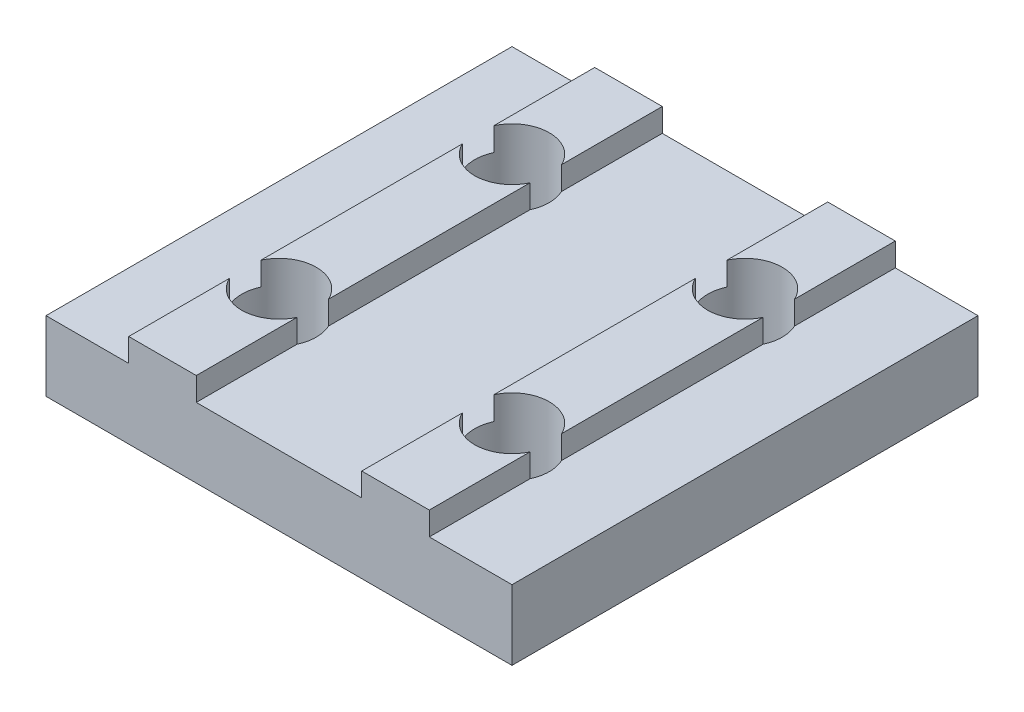
ISO-10303-21;
HEADER;
FILE_DESCRIPTION(('STEP AP214'),'2;1');
FILE_NAME('part.step','',(''),(''),'','','');
FILE_SCHEMA(('AUTOMOTIVE_DESIGN { 1 0 10303 214 1 1 1 1 }'));
ENDSEC;
DATA;
#1=APPLICATION_CONTEXT('core data for automotive mechanical design processes');
#2=APPLICATION_PROTOCOL_DEFINITION('international standard','automotive_design',2000,#1);
#3=PRODUCT_CONTEXT('',#1,'mechanical');
#4=PRODUCT('Part','Part','',(#3));
#5=PRODUCT_RELATED_PRODUCT_CATEGORY('part','',(#4));
#6=PRODUCT_DEFINITION_FORMATION('','',#4);
#7=PRODUCT_DEFINITION_CONTEXT('part definition',#1,'design');
#8=PRODUCT_DEFINITION('design','',#6,#7);
#9=PRODUCT_DEFINITION_SHAPE('','',#8);
#10=(LENGTH_UNIT() NAMED_UNIT(*) SI_UNIT(.MILLI.,.METRE.));
#11=(NAMED_UNIT(*) PLANE_ANGLE_UNIT() SI_UNIT($,.RADIAN.));
#12=(NAMED_UNIT(*) SI_UNIT($,.STERADIAN.) SOLID_ANGLE_UNIT());
#13=UNCERTAINTY_MEASURE_WITH_UNIT(LENGTH_MEASURE(1.E-05),#10,'distance_accuracy_value','');
#14=(GEOMETRIC_REPRESENTATION_CONTEXT(3) GLOBAL_UNCERTAINTY_ASSIGNED_CONTEXT((#13)) GLOBAL_UNIT_ASSIGNED_CONTEXT((#10,
#11,#12)) REPRESENTATION_CONTEXT('',''));
#15=CARTESIAN_POINT('',(0.,0.,0.));
#16=DIRECTION('',(0.,0.,1.));
#17=DIRECTION('',(1.,0.,0.));
#18=AXIS2_PLACEMENT_3D('',#15,#16,#17);
#19=CARTESIAN_POINT('',(-8.55,4.,20.));
#20=DIRECTION('',(-1.,0.,0.));
#21=DIRECTION('',(0.,-1.,0.));
#22=AXIS2_PLACEMENT_3D('',#19,#20,#21);
#23=PLANE('',#22);
#24=DIRECTION('',(0.,0.,-1.));
#25=VECTOR('',#24,1.);
#26=CARTESIAN_POINT('',(-8.55,3.,20.));
#27=LINE('',#26,#25);
#28=CARTESIAN_POINT('',(-8.55,3.,20.));
#29=VERTEX_POINT('',#28);
#30=CARTESIAN_POINT('',(-8.55,3.,15.6763874629234));
#31=VERTEX_POINT('',#30);
#32=EDGE_CURVE('E236',#29,#31,#27,.T.);
#33=ORIENTED_EDGE('',*,*,#32,.T.);
#34=DIRECTION('',(0.,1.,0.));
#35=VECTOR('',#34,1.);
#36=CARTESIAN_POINT('',(-8.55,0.,15.6763874629234));
#37=LINE('',#36,#35);
#38=CARTESIAN_POINT('',(-8.55,4.,15.6763874629234));
#39=VERTEX_POINT('',#38);
#40=EDGE_CURVE('E219',#31,#39,#37,.T.);
#41=ORIENTED_EDGE('',*,*,#40,.T.);
#42=DIRECTION('',(0.,0.,-1.));
#43=VECTOR('',#42,1.);
#44=CARTESIAN_POINT('',(-8.55,4.,20.));
#45=LINE('',#44,#43);
#46=CARTESIAN_POINT('',(-8.55,4.,20.));
#47=VERTEX_POINT('',#46);
#48=EDGE_CURVE('E233',#47,#39,#45,.T.);
#49=ORIENTED_EDGE('',*,*,#48,.F.);
#50=DIRECTION('',(0.,1.,0.));
#51=VECTOR('',#50,1.);
#52=CARTESIAN_POINT('',(-8.55,4.,20.));
#53=LINE('',#52,#51);
#54=EDGE_CURVE('E286',#29,#47,#53,.T.);
#55=ORIENTED_EDGE('',*,*,#54,.F.);
#56=EDGE_LOOP('',(#33,#41,#49,#55));
#57=FACE_BOUND('',#56,.T.);
#58=ADVANCED_FACE('F33',(#57),#23,.F.);
#59=CARTESIAN_POINT('',(-11.45,4.,20.));
#60=DIRECTION('',(0.,-1.,0.));
#61=DIRECTION('',(1.,0.,0.));
#62=AXIS2_PLACEMENT_3D('',#59,#60,#61);
#63=PLANE('',#62);
#64=ORIENTED_EDGE('',*,*,#48,.T.);
#65=CARTESIAN_POINT('',(-10.,4.,15.));
#66=DIRECTION('',(0.,1.,0.));
#67=DIRECTION('',(0.,0.,1.));
#68=AXIS2_PLACEMENT_3D('',#65,#66,#67);
#69=CIRCLE('',#68,1.6);
#70=CARTESIAN_POINT('',(-11.45,4.,15.6763874629234));
#71=VERTEX_POINT('',#70);
#72=EDGE_CURVE('E216',#71,#39,#69,.T.);
#73=ORIENTED_EDGE('',*,*,#72,.F.);
#74=DIRECTION('',(0.,0.,-1.));
#75=VECTOR('',#74,1.);
#76=CARTESIAN_POINT('',(-11.45,4.,20.));
#77=LINE('',#76,#75);
#78=CARTESIAN_POINT('',(-11.45,4.,20.));
#79=VERTEX_POINT('',#78);
#80=EDGE_CURVE('E249',#79,#71,#77,.T.);
#81=ORIENTED_EDGE('',*,*,#80,.F.);
#82=DIRECTION('',(-1.,0.,0.));
#83=VECTOR('',#82,1.);
#84=CARTESIAN_POINT('',(-11.45,4.,20.));
#85=LINE('',#84,#83);
#86=EDGE_CURVE('E241',#47,#79,#85,.T.);
#87=ORIENTED_EDGE('',*,*,#86,.F.);
#88=EDGE_LOOP('',(#64,#73,#81,#87));
#89=FACE_BOUND('',#88,.T.);
#90=ADVANCED_FACE('F240',(#89),#63,.F.);
#91=CARTESIAN_POINT('',(-11.45,3.,20.));
#92=DIRECTION('',(1.,0.,0.));
#93=DIRECTION('',(0.,0.,-1.));
#94=AXIS2_PLACEMENT_3D('',#91,#92,#93);
#95=PLANE('',#94);
#96=DIRECTION('',(0.,0.,-1.));
#97=VECTOR('',#96,1.);
#98=CARTESIAN_POINT('',(-11.45,3.,20.));
#99=LINE('',#98,#97);
#100=CARTESIAN_POINT('',(-11.45,3.,14.3236125370766));
#101=VERTEX_POINT('',#100);
#102=CARTESIAN_POINT('',(-11.45,3.,5.67638746292343));
#103=VERTEX_POINT('',#102);
#104=EDGE_CURVE('E265',#101,#103,#99,.T.);
#105=ORIENTED_EDGE('',*,*,#104,.F.);
#106=DIRECTION('',(0.,1.,0.));
#107=VECTOR('',#106,1.);
#108=CARTESIAN_POINT('',(-11.45,0.,14.3236125370766));
#109=LINE('',#108,#107);
#110=CARTESIAN_POINT('',(-11.45,4.,14.3236125370766));
#111=VERTEX_POINT('',#110);
#112=EDGE_CURVE('E48',#101,#111,#109,.T.);
#113=ORIENTED_EDGE('',*,*,#112,.T.);
#114=CARTESIAN_POINT('',(-11.45,4.,5.67638746292343));
#115=VERTEX_POINT('',#114);
#116=EDGE_CURVE('E255',#111,#115,#77,.T.);
#117=ORIENTED_EDGE('',*,*,#116,.T.);
#118=DIRECTION('',(0.,1.,0.));
#119=VECTOR('',#118,1.);
#120=CARTESIAN_POINT('',(-11.45,0.,5.67638746292343));
#121=LINE('',#120,#119);
#122=EDGE_CURVE('E313',#115,#103,#121,.F.);
#123=ORIENTED_EDGE('',*,*,#122,.T.);
#124=EDGE_LOOP('',(#105,#113,#117,#123));
#125=FACE_BOUND('',#124,.T.);
#126=ADVANCED_FACE('F338',(#125),#95,.F.);
#127=CARTESIAN_POINT('',(-8.55,4.,14.3236125370766));
#128=VERTEX_POINT('',#127);
#129=CARTESIAN_POINT('',(-8.55,4.,5.67638746292344));
#130=VERTEX_POINT('',#129);
#131=EDGE_CURVE('E243',#128,#130,#45,.T.);
#132=ORIENTED_EDGE('',*,*,#131,.F.);
#133=DIRECTION('',(0.,1.,0.));
#134=VECTOR('',#133,1.);
#135=CARTESIAN_POINT('',(-8.55,0.,14.3236125370766));
#136=LINE('',#135,#134);
#137=CARTESIAN_POINT('',(-8.55,3.,14.3236125370766));
#138=VERTEX_POINT('',#137);
#139=EDGE_CURVE('E238',#128,#138,#136,.F.);
#140=ORIENTED_EDGE('',*,*,#139,.T.);
#141=CARTESIAN_POINT('',(-8.55,3.,5.67638746292343));
#142=VERTEX_POINT('',#141);
#143=EDGE_CURVE('E246',#138,#142,#27,.T.);
#144=ORIENTED_EDGE('',*,*,#143,.T.);
#145=DIRECTION('',(0.,1.,0.));
#146=VECTOR('',#145,1.);
#147=CARTESIAN_POINT('',(-8.55,0.,5.67638746292343));
#148=LINE('',#147,#146);
#149=EDGE_CURVE('E295',#142,#130,#148,.T.);
#150=ORIENTED_EDGE('',*,*,#149,.T.);
#151=EDGE_LOOP('',(#132,#140,#144,#150));
#152=FACE_BOUND('',#151,.T.);
#153=ADVANCED_FACE('F345',(#152),#23,.F.);
#154=ORIENTED_EDGE('',*,*,#116,.F.);
#155=EDGE_CURVE('E227',#128,#111,#69,.T.);
#156=ORIENTED_EDGE('',*,*,#155,.F.);
#157=ORIENTED_EDGE('',*,*,#131,.T.);
#158=CARTESIAN_POINT('',(-10.,4.,5.));
#159=DIRECTION('',(0.,1.,0.));
#160=DIRECTION('',(0.,0.,1.));
#161=AXIS2_PLACEMENT_3D('',#158,#159,#160);
#162=CIRCLE('',#161,1.6);
#163=EDGE_CURVE('E237',#115,#130,#162,.T.);
#164=ORIENTED_EDGE('',*,*,#163,.F.);
#165=EDGE_LOOP('',(#154,#156,#157,#164));
#166=FACE_BOUND('',#165,.T.);
#167=ADVANCED_FACE('F341',(#166),#63,.F.);
#168=CARTESIAN_POINT('',(-11.45,3.,4.32361253707657));
#169=VERTEX_POINT('',#168);
#170=CARTESIAN_POINT('',(-11.45,3.,0.));
#171=VERTEX_POINT('',#170);
#172=EDGE_CURVE('E266',#169,#171,#99,.T.);
#173=ORIENTED_EDGE('',*,*,#172,.F.);
#174=DIRECTION('',(0.,1.,0.));
#175=VECTOR('',#174,1.);
#176=CARTESIAN_POINT('',(-11.45,0.,4.32361253707657));
#177=LINE('',#176,#175);
#178=CARTESIAN_POINT('',(-11.45,4.,4.32361253707657));
#179=VERTEX_POINT('',#178);
#180=EDGE_CURVE('E55',#169,#179,#177,.T.);
#181=ORIENTED_EDGE('',*,*,#180,.T.);
#182=CARTESIAN_POINT('',(-11.45,4.,0.));
#183=VERTEX_POINT('',#182);
#184=EDGE_CURVE('E256',#179,#183,#77,.T.);
#185=ORIENTED_EDGE('',*,*,#184,.T.);
#186=DIRECTION('',(0.,-1.,0.));
#187=VECTOR('',#186,1.);
#188=CARTESIAN_POINT('',(-11.45,3.,0.));
#189=LINE('',#188,#187);
#190=EDGE_CURVE('E289',#183,#171,#189,.T.);
#191=ORIENTED_EDGE('',*,*,#190,.T.);
#192=EDGE_LOOP('',(#173,#181,#185,#191));
#193=FACE_BOUND('',#192,.T.);
#194=ADVANCED_FACE('F459',(#193),#95,.F.);
#195=CARTESIAN_POINT('',(1.45,4.,20.));
#196=DIRECTION('',(-1.,0.,0.));
#197=DIRECTION('',(0.,-1.,0.));
#198=AXIS2_PLACEMENT_3D('',#195,#196,#197);
#199=PLANE('',#198);
#200=DIRECTION('',(0.,0.,-1.));
#201=VECTOR('',#200,1.);
#202=CARTESIAN_POINT('',(1.45,3.,20.));
#203=LINE('',#202,#201);
#204=CARTESIAN_POINT('',(1.45,3.,20.));
#205=VERTEX_POINT('',#204);
#206=CARTESIAN_POINT('',(1.45,3.,15.6763874629234));
#207=VERTEX_POINT('',#206);
#208=EDGE_CURVE('E443',#205,#207,#203,.T.);
#209=ORIENTED_EDGE('',*,*,#208,.T.);
#210=DIRECTION('',(0.,1.,0.));
#211=VECTOR('',#210,1.);
#212=CARTESIAN_POINT('',(1.45,0.,15.6763874629234));
#213=LINE('',#212,#211);
#214=CARTESIAN_POINT('',(1.45,4.,15.6763874629234));
#215=VERTEX_POINT('',#214);
#216=EDGE_CURVE('E367',#207,#215,#213,.T.);
#217=ORIENTED_EDGE('',*,*,#216,.T.);
#218=DIRECTION('',(0.,0.,-1.));
#219=VECTOR('',#218,1.);
#220=CARTESIAN_POINT('',(1.45,4.,20.));
#221=LINE('',#220,#219);
#222=CARTESIAN_POINT('',(1.45,4.,20.));
#223=VERTEX_POINT('',#222);
#224=EDGE_CURVE('E438',#223,#215,#221,.T.);
#225=ORIENTED_EDGE('',*,*,#224,.F.);
#226=DIRECTION('',(0.,1.,0.));
#227=VECTOR('',#226,1.);
#228=CARTESIAN_POINT('',(1.45,4.,20.));
#229=LINE('',#228,#227);
#230=EDGE_CURVE('E401',#205,#223,#229,.T.);
#231=ORIENTED_EDGE('',*,*,#230,.F.);
#232=EDGE_LOOP('',(#209,#217,#225,#231));
#233=FACE_BOUND('',#232,.T.);
#234=ADVANCED_FACE('F483',(#233),#199,.F.);
#235=CARTESIAN_POINT('',(-1.45,4.,20.));
#236=DIRECTION('',(0.,-1.,0.));
#237=DIRECTION('',(1.,0.,0.));
#238=AXIS2_PLACEMENT_3D('',#235,#236,#237);
#239=PLANE('',#238);
#240=ORIENTED_EDGE('',*,*,#224,.T.);
#241=CARTESIAN_POINT('',(0.,4.,15.));
#242=DIRECTION('',(0.,1.,0.));
#243=DIRECTION('',(0.,0.,1.));
#244=AXIS2_PLACEMENT_3D('',#241,#242,#243);
#245=CIRCLE('',#244,1.6);
#246=CARTESIAN_POINT('',(-1.45,4.,15.6763874629234));
#247=VERTEX_POINT('',#246);
#248=EDGE_CURVE('E348',#247,#215,#245,.T.);
#249=ORIENTED_EDGE('',*,*,#248,.F.);
#250=DIRECTION('',(0.,0.,-1.));
#251=VECTOR('',#250,1.);
#252=CARTESIAN_POINT('',(-1.45,4.,20.));
#253=LINE('',#252,#251);
#254=CARTESIAN_POINT('',(-1.45,4.,20.));
#255=VERTEX_POINT('',#254);
#256=EDGE_CURVE('E433',#255,#247,#253,.T.);
#257=ORIENTED_EDGE('',*,*,#256,.F.);
#258=DIRECTION('',(-1.,0.,0.));
#259=VECTOR('',#258,1.);
#260=CARTESIAN_POINT('',(-1.45,4.,20.));
#261=LINE('',#260,#259);
#262=EDGE_CURVE('E403',#223,#255,#261,.T.);
#263=ORIENTED_EDGE('',*,*,#262,.F.);
#264=EDGE_LOOP('',(#240,#249,#257,#263));
#265=FACE_BOUND('',#264,.T.);
#266=ADVANCED_FACE('F569',(#265),#239,.F.);
#267=CARTESIAN_POINT('',(-1.45,3.,20.));
#268=DIRECTION('',(1.,0.,0.));
#269=DIRECTION('',(0.,0.,-1.));
#270=AXIS2_PLACEMENT_3D('',#267,#268,#269);
#271=PLANE('',#270);
#272=DIRECTION('',(0.,0.,-1.));
#273=VECTOR('',#272,1.);
#274=CARTESIAN_POINT('',(-1.45,3.,20.));
#275=LINE('',#274,#273);
#276=CARTESIAN_POINT('',(-1.45,3.,14.3236125370766));
#277=VERTEX_POINT('',#276);
#278=CARTESIAN_POINT('',(-1.45,3.,5.67638746292343));
#279=VERTEX_POINT('',#278);
#280=EDGE_CURVE('E432',#277,#279,#275,.T.);
#281=ORIENTED_EDGE('',*,*,#280,.F.);
#282=DIRECTION('',(0.,1.,0.));
#283=VECTOR('',#282,1.);
#284=CARTESIAN_POINT('',(-1.45,0.,14.3236125370766));
#285=LINE('',#284,#283);
#286=CARTESIAN_POINT('',(-1.45,4.,14.3236125370766));
#287=VERTEX_POINT('',#286);
#288=EDGE_CURVE('E358',#277,#287,#285,.T.);
#289=ORIENTED_EDGE('',*,*,#288,.T.);
#290=CARTESIAN_POINT('',(-1.45,4.,5.67638746292343));
#291=VERTEX_POINT('',#290);
#292=EDGE_CURVE('E437',#287,#291,#253,.T.);
#293=ORIENTED_EDGE('',*,*,#292,.T.);
#294=DIRECTION('',(0.,1.,0.));
#295=VECTOR('',#294,1.);
#296=CARTESIAN_POINT('',(-1.45,0.,5.67638746292343));
#297=LINE('',#296,#295);
#298=EDGE_CURVE('E374',#291,#279,#297,.F.);
#299=ORIENTED_EDGE('',*,*,#298,.T.);
#300=EDGE_LOOP('',(#281,#289,#293,#299));
#301=FACE_BOUND('',#300,.T.);
#302=ADVANCED_FACE('F537',(#301),#271,.F.);
#303=CARTESIAN_POINT('',(1.45,4.,14.3236125370766));
#304=VERTEX_POINT('',#303);
#305=CARTESIAN_POINT('',(1.45,4.,5.67638746292344));
#306=VERTEX_POINT('',#305);
#307=EDGE_CURVE('E442',#304,#306,#221,.T.);
#308=ORIENTED_EDGE('',*,*,#307,.F.);
#309=DIRECTION('',(0.,1.,0.));
#310=VECTOR('',#309,1.);
#311=CARTESIAN_POINT('',(1.45,0.,14.3236125370766));
#312=LINE('',#311,#310);
#313=CARTESIAN_POINT('',(1.45,3.,14.3236125370766));
#314=VERTEX_POINT('',#313);
#315=EDGE_CURVE('E364',#304,#314,#312,.F.);
#316=ORIENTED_EDGE('',*,*,#315,.T.);
#317=CARTESIAN_POINT('',(1.45,3.,5.67638746292344));
#318=VERTEX_POINT('',#317);
#319=EDGE_CURVE('E447',#314,#318,#203,.T.);
#320=ORIENTED_EDGE('',*,*,#319,.T.);
#321=DIRECTION('',(0.,1.,0.));
#322=VECTOR('',#321,1.);
#323=CARTESIAN_POINT('',(1.45,0.,5.67638746292343));
#324=LINE('',#323,#322);
#325=EDGE_CURVE('E389',#318,#306,#324,.T.);
#326=ORIENTED_EDGE('',*,*,#325,.T.);
#327=EDGE_LOOP('',(#308,#316,#320,#326));
#328=FACE_BOUND('',#327,.T.);
#329=ADVANCED_FACE('F551',(#328),#199,.F.);
#330=ORIENTED_EDGE('',*,*,#292,.F.);
#331=EDGE_CURVE('E354',#304,#287,#245,.T.);
#332=ORIENTED_EDGE('',*,*,#331,.F.);
#333=ORIENTED_EDGE('',*,*,#307,.T.);
#334=CARTESIAN_POINT('',(0.,4.,5.));
#335=DIRECTION('',(0.,1.,0.));
#336=DIRECTION('',(0.,0.,1.));
#337=AXIS2_PLACEMENT_3D('',#334,#335,#336);
#338=CIRCLE('',#337,1.6);
#339=EDGE_CURVE('E370',#291,#306,#338,.T.);
#340=ORIENTED_EDGE('',*,*,#339,.F.);
#341=EDGE_LOOP('',(#330,#332,#333,#340));
#342=FACE_BOUND('',#341,.T.);
#343=ADVANCED_FACE('F534',(#342),#239,.F.);
#344=CARTESIAN_POINT('',(-1.45,3.,4.32361253707657));
#345=VERTEX_POINT('',#344);
#346=CARTESIAN_POINT('',(-1.45,3.,0.));
#347=VERTEX_POINT('',#346);
#348=EDGE_CURVE('E409',#345,#347,#275,.T.);
#349=ORIENTED_EDGE('',*,*,#348,.F.);
#350=DIRECTION('',(0.,1.,0.));
#351=VECTOR('',#350,1.);
#352=CARTESIAN_POINT('',(-1.45,0.,4.32361253707657));
#353=LINE('',#352,#351);
#354=CARTESIAN_POINT('',(-1.45,4.,4.32361253707657));
#355=VERTEX_POINT('',#354);
#356=EDGE_CURVE('E380',#345,#355,#353,.T.);
#357=ORIENTED_EDGE('',*,*,#356,.T.);
#358=CARTESIAN_POINT('',(-1.45,4.,0.));
#359=VERTEX_POINT('',#358);
#360=EDGE_CURVE('E431',#355,#359,#253,.T.);
#361=ORIENTED_EDGE('',*,*,#360,.T.);
#362=DIRECTION('',(0.,-1.,0.));
#363=VECTOR('',#362,1.);
#364=CARTESIAN_POINT('',(-1.45,3.,0.));
#365=LINE('',#364,#363);
#366=EDGE_CURVE('E423',#359,#347,#365,.T.);
#367=ORIENTED_EDGE('',*,*,#366,.T.);
#368=EDGE_LOOP('',(#349,#357,#361,#367));
#369=FACE_BOUND('',#368,.T.);
#370=ADVANCED_FACE('F509',(#369),#271,.F.);
#371=CARTESIAN_POINT('',(5.,0.,20.));
#372=DIRECTION('',(0.,1.,0.));
#373=DIRECTION('',(-1.,0.,0.));
#374=AXIS2_PLACEMENT_3D('',#371,#372,#373);
#375=PLANE('',#374);
#376=CARTESIAN_POINT('',(-10.,0.,15.));
#377=DIRECTION('',(0.,1.,0.));
#378=DIRECTION('',(0.,0.,1.));
#379=AXIS2_PLACEMENT_3D('',#376,#377,#378);
#380=CIRCLE('',#379,1.6);
#381=CARTESIAN_POINT('',(-10.,0.,16.6));
#382=VERTEX_POINT('',#381);
#383=EDGE_CURVE('E327',#382,#382,#380,.T.);
#384=ORIENTED_EDGE('',*,*,#383,.T.);
#385=EDGE_LOOP('',(#384));
#386=FACE_BOUND('',#385,.T.);
#387=CARTESIAN_POINT('',(-10.,0.,5.));
#388=DIRECTION('',(0.,1.,0.));
#389=DIRECTION('',(0.,0.,1.));
#390=AXIS2_PLACEMENT_3D('',#387,#388,#389);
#391=CIRCLE('',#390,1.6);
#392=CARTESIAN_POINT('',(-10.,0.,6.6));
#393=VERTEX_POINT('',#392);
#394=EDGE_CURVE('E316',#393,#393,#391,.T.);
#395=ORIENTED_EDGE('',*,*,#394,.T.);
#396=EDGE_LOOP('',(#395));
#397=FACE_BOUND('',#396,.T.);
#398=CARTESIAN_POINT('',(0.,0.,15.));
#399=DIRECTION('',(0.,1.,0.));
#400=DIRECTION('',(0.,0.,1.));
#401=AXIS2_PLACEMENT_3D('',#398,#399,#400);
#402=CIRCLE('',#401,1.6);
#403=CARTESIAN_POINT('',(0.,0.,16.6));
#404=VERTEX_POINT('',#403);
#405=EDGE_CURVE('E350',#404,#404,#402,.T.);
#406=ORIENTED_EDGE('',*,*,#405,.T.);
#407=EDGE_LOOP('',(#406));
#408=FACE_BOUND('',#407,.T.);
#409=CARTESIAN_POINT('',(0.,0.,5.));
#410=DIRECTION('',(0.,1.,0.));
#411=DIRECTION('',(0.,0.,1.));
#412=AXIS2_PLACEMENT_3D('',#409,#410,#411);
#413=CIRCLE('',#412,1.6);
#414=CARTESIAN_POINT('',(0.,0.,6.6));
#415=VERTEX_POINT('',#414);
#416=EDGE_CURVE('E371',#415,#415,#413,.T.);
#417=ORIENTED_EDGE('',*,*,#416,.T.);
#418=EDGE_LOOP('',(#417));
#419=FACE_BOUND('',#418,.T.);
#420=DIRECTION('',(1.,0.,0.));
#421=VECTOR('',#420,1.);
#422=CARTESIAN_POINT('',(5.,0.,0.));
#423=LINE('',#422,#421);
#424=CARTESIAN_POINT('',(-15.,0.,0.));
#425=VERTEX_POINT('',#424);
#426=CARTESIAN_POINT('',(5.,0.,0.));
#427=VERTEX_POINT('',#426);
#428=EDGE_CURVE('E392',#425,#427,#423,.T.);
#429=ORIENTED_EDGE('',*,*,#428,.T.);
#430=DIRECTION('',(0.,0.,-1.));
#431=VECTOR('',#430,1.);
#432=CARTESIAN_POINT('',(5.,0.,20.));
#433=LINE('',#432,#431);
#434=CARTESIAN_POINT('',(5.,0.,20.));
#435=VERTEX_POINT('',#434);
#436=EDGE_CURVE('E450',#435,#427,#433,.T.);
#437=ORIENTED_EDGE('',*,*,#436,.F.);
#438=DIRECTION('',(1.,0.,0.));
#439=VECTOR('',#438,1.);
#440=CARTESIAN_POINT('',(5.,0.,20.));
#441=LINE('',#440,#439);
#442=CARTESIAN_POINT('',(-15.,0.,20.));
#443=VERTEX_POINT('',#442);
#444=EDGE_CURVE('E393',#443,#435,#441,.T.);
#445=ORIENTED_EDGE('',*,*,#444,.F.);
#446=DIRECTION('',(0.,0.,-1.));
#447=VECTOR('',#446,1.);
#448=CARTESIAN_POINT('',(-15.,0.,20.));
#449=LINE('',#448,#447);
#450=EDGE_CURVE('E274',#443,#425,#449,.T.);
#451=ORIENTED_EDGE('',*,*,#450,.T.);
#452=EDGE_LOOP('',(#429,#437,#445,#451));
#453=FACE_BOUND('',#452,.T.);
#454=ADVANCED_FACE('F35',(#386,#397,#408,#419,#453),#375,.F.);
#455=CARTESIAN_POINT('',(5.,3.,20.));
#456=DIRECTION('',(-1.,0.,0.));
#457=DIRECTION('',(0.,-1.,0.));
#458=AXIS2_PLACEMENT_3D('',#455,#456,#457);
#459=PLANE('',#458);
#460=DIRECTION('',(0.,1.,0.));
#461=VECTOR('',#460,1.);
#462=CARTESIAN_POINT('',(5.,3.,0.));
#463=LINE('',#462,#461);
#464=CARTESIAN_POINT('',(5.,3.,0.));
#465=VERTEX_POINT('',#464);
#466=EDGE_CURVE('E412',#427,#465,#463,.T.);
#467=ORIENTED_EDGE('',*,*,#466,.T.);
#468=DIRECTION('',(0.,0.,-1.));
#469=VECTOR('',#468,1.);
#470=CARTESIAN_POINT('',(5.,3.,20.));
#471=LINE('',#470,#469);
#472=CARTESIAN_POINT('',(5.,3.,20.));
#473=VERTEX_POINT('',#472);
#474=EDGE_CURVE('E446',#473,#465,#471,.T.);
#475=ORIENTED_EDGE('',*,*,#474,.F.);
#476=DIRECTION('',(0.,1.,0.));
#477=VECTOR('',#476,1.);
#478=CARTESIAN_POINT('',(5.,3.,20.));
#479=LINE('',#478,#477);
#480=EDGE_CURVE('E396',#435,#473,#479,.T.);
#481=ORIENTED_EDGE('',*,*,#480,.F.);
#482=ORIENTED_EDGE('',*,*,#436,.T.);
#483=EDGE_LOOP('',(#467,#475,#481,#482));
#484=FACE_BOUND('',#483,.T.);
#485=ADVANCED_FACE('F526',(#484),#459,.F.);
#486=CARTESIAN_POINT('',(1.45,3.,20.));
#487=DIRECTION('',(0.,-1.,0.));
#488=DIRECTION('',(1.,0.,0.));
#489=AXIS2_PLACEMENT_3D('',#486,#487,#488);
#490=PLANE('',#489);
#491=ORIENTED_EDGE('',*,*,#319,.F.);
#492=CARTESIAN_POINT('',(0.,3.,15.));
#493=DIRECTION('',(0.,-1.,0.));
#494=DIRECTION('',(1.,0.,0.));
#495=AXIS2_PLACEMENT_3D('',#492,#493,#494);
#496=CIRCLE('',#495,1.6);
#497=EDGE_CURVE('E361',#314,#207,#496,.T.);
#498=ORIENTED_EDGE('',*,*,#497,.T.);
#499=ORIENTED_EDGE('',*,*,#208,.F.);
#500=DIRECTION('',(-1.,0.,0.));
#501=VECTOR('',#500,1.);
#502=CARTESIAN_POINT('',(1.45,3.,20.));
#503=LINE('',#502,#501);
#504=EDGE_CURVE('E399',#473,#205,#503,.T.);
#505=ORIENTED_EDGE('',*,*,#504,.F.);
#506=ORIENTED_EDGE('',*,*,#474,.T.);
#507=DIRECTION('',(-1.,0.,0.));
#508=VECTOR('',#507,1.);
#509=CARTESIAN_POINT('',(1.45,3.,0.));
#510=LINE('',#509,#508);
#511=CARTESIAN_POINT('',(1.45,3.,0.));
#512=VERTEX_POINT('',#511);
#513=EDGE_CURVE('E414',#465,#512,#510,.T.);
#514=ORIENTED_EDGE('',*,*,#513,.T.);
#515=CARTESIAN_POINT('',(1.45,3.,4.32361253707657));
#516=VERTEX_POINT('',#515);
#517=EDGE_CURVE('E441',#516,#512,#203,.T.);
#518=ORIENTED_EDGE('',*,*,#517,.F.);
#519=CARTESIAN_POINT('',(0.,3.,5.));
#520=DIRECTION('',(0.,-1.,0.));
#521=DIRECTION('',(1.,0.,0.));
#522=AXIS2_PLACEMENT_3D('',#519,#520,#521);
#523=CIRCLE('',#522,1.6);
#524=EDGE_CURVE('E386',#516,#318,#523,.T.);
#525=ORIENTED_EDGE('',*,*,#524,.T.);
#526=EDGE_LOOP('',(#491,#498,#499,#505,#506,#514,#518,#525));
#527=FACE_BOUND('',#526,.T.);
#528=ADVANCED_FACE('F521',(#527),#490,.F.);
#529=CARTESIAN_POINT('',(1.45,4.,4.32361253707656));
#530=VERTEX_POINT('',#529);
#531=CARTESIAN_POINT('',(1.45,4.,0.));
#532=VERTEX_POINT('',#531);
#533=EDGE_CURVE('E436',#530,#532,#221,.T.);
#534=ORIENTED_EDGE('',*,*,#533,.F.);
#535=DIRECTION('',(0.,1.,0.));
#536=VECTOR('',#535,1.);
#537=CARTESIAN_POINT('',(1.45,0.,4.32361253707657));
#538=LINE('',#537,#536);
#539=EDGE_CURVE('E383',#530,#516,#538,.F.);
#540=ORIENTED_EDGE('',*,*,#539,.T.);
#541=ORIENTED_EDGE('',*,*,#517,.T.);
#542=DIRECTION('',(0.,1.,0.));
#543=VECTOR('',#542,1.);
#544=CARTESIAN_POINT('',(1.45,4.,0.));
#545=LINE('',#544,#543);
#546=EDGE_CURVE('E417',#512,#532,#545,.T.);
#547=ORIENTED_EDGE('',*,*,#546,.T.);
#548=EDGE_LOOP('',(#534,#540,#541,#547));
#549=FACE_BOUND('',#548,.T.);
#550=ADVANCED_FACE('F516',(#549),#199,.F.);
#551=ORIENTED_EDGE('',*,*,#360,.F.);
#552=EDGE_CURVE('E375',#530,#355,#338,.T.);
#553=ORIENTED_EDGE('',*,*,#552,.F.);
#554=ORIENTED_EDGE('',*,*,#533,.T.);
#555=DIRECTION('',(-1.,0.,0.));
#556=VECTOR('',#555,1.);
#557=CARTESIAN_POINT('',(-1.45,4.,0.));
#558=LINE('',#557,#556);
#559=EDGE_CURVE('E420',#532,#359,#558,.T.);
#560=ORIENTED_EDGE('',*,*,#559,.T.);
#561=EDGE_LOOP('',(#551,#553,#554,#560));
#562=FACE_BOUND('',#561,.T.);
#563=ADVANCED_FACE('F513',(#562),#239,.F.);
#564=ORIENTED_EDGE('',*,*,#256,.T.);
#565=DIRECTION('',(0.,1.,0.));
#566=VECTOR('',#565,1.);
#567=CARTESIAN_POINT('',(-1.45,0.,15.6763874629234));
#568=LINE('',#567,#566);
#569=CARTESIAN_POINT('',(-1.45,3.,15.6763874629234));
#570=VERTEX_POINT('',#569);
#571=EDGE_CURVE('E353',#247,#570,#568,.F.);
#572=ORIENTED_EDGE('',*,*,#571,.T.);
#573=CARTESIAN_POINT('',(-1.45,3.,20.));
#574=VERTEX_POINT('',#573);
#575=EDGE_CURVE('E428',#574,#570,#275,.T.);
#576=ORIENTED_EDGE('',*,*,#575,.F.);
#577=DIRECTION('',(0.,-1.,0.));
#578=VECTOR('',#577,1.);
#579=CARTESIAN_POINT('',(-1.45,3.,20.));
#580=LINE('',#579,#578);
#581=EDGE_CURVE('E405',#255,#574,#580,.T.);
#582=ORIENTED_EDGE('',*,*,#581,.F.);
#583=EDGE_LOOP('',(#564,#572,#576,#582));
#584=FACE_BOUND('',#583,.T.);
#585=ADVANCED_FACE('F536',(#584),#271,.F.);
#586=CARTESIAN_POINT('',(-5.,3.,20.));
#587=DIRECTION('',(0.,-1.,0.));
#588=DIRECTION('',(0.,0.,-1.));
#589=AXIS2_PLACEMENT_3D('',#586,#587,#588);
#590=PLANE('',#589);
#591=ORIENTED_EDGE('',*,*,#143,.F.);
#592=CARTESIAN_POINT('',(-10.,3.,15.));
#593=DIRECTION('',(0.,-1.,0.));
#594=DIRECTION('',(0.,0.,-1.));
#595=AXIS2_PLACEMENT_3D('',#592,#593,#594);
#596=CIRCLE('',#595,1.6);
#597=EDGE_CURVE('E324',#138,#31,#596,.T.);
#598=ORIENTED_EDGE('',*,*,#597,.T.);
#599=ORIENTED_EDGE('',*,*,#32,.F.);
#600=DIRECTION('',(-1.,0.,0.));
#601=VECTOR('',#600,1.);
#602=CARTESIAN_POINT('',(-5.,3.,20.));
#603=LINE('',#602,#601);
#604=EDGE_CURVE('E407',#574,#29,#603,.T.);
#605=ORIENTED_EDGE('',*,*,#604,.F.);
#606=ORIENTED_EDGE('',*,*,#575,.T.);
#607=CARTESIAN_POINT('',(0.,3.,15.));
#608=DIRECTION('',(0.,-1.,0.));
#609=DIRECTION('',(0.,0.,-1.));
#610=AXIS2_PLACEMENT_3D('',#607,#608,#609);
#611=CIRCLE('',#610,1.6);
#612=EDGE_CURVE('E456',#570,#277,#611,.T.);
#613=ORIENTED_EDGE('',*,*,#612,.T.);
#614=ORIENTED_EDGE('',*,*,#280,.T.);
#615=CARTESIAN_POINT('',(0.,3.,5.));
#616=DIRECTION('',(0.,-1.,0.));
#617=DIRECTION('',(0.,0.,-1.));
#618=AXIS2_PLACEMENT_3D('',#615,#616,#617);
#619=CIRCLE('',#618,1.6);
#620=EDGE_CURVE('E453',#279,#345,#619,.T.);
#621=ORIENTED_EDGE('',*,*,#620,.T.);
#622=ORIENTED_EDGE('',*,*,#348,.T.);
#623=DIRECTION('',(-1.,0.,0.));
#624=VECTOR('',#623,1.);
#625=CARTESIAN_POINT('',(-5.,3.,0.));
#626=LINE('',#625,#624);
#627=CARTESIAN_POINT('',(-8.55,3.,0.));
#628=VERTEX_POINT('',#627);
#629=EDGE_CURVE('E397',#347,#628,#626,.T.);
#630=ORIENTED_EDGE('',*,*,#629,.T.);
#631=CARTESIAN_POINT('',(-8.55,3.,4.32361253707657));
#632=VERTEX_POINT('',#631);
#633=EDGE_CURVE('E242',#632,#628,#27,.T.);
#634=ORIENTED_EDGE('',*,*,#633,.F.);
#635=CARTESIAN_POINT('',(-10.,3.,5.));
#636=DIRECTION('',(0.,-1.,0.));
#637=DIRECTION('',(0.,0.,-1.));
#638=AXIS2_PLACEMENT_3D('',#635,#636,#637);
#639=CIRCLE('',#638,1.6);
#640=EDGE_CURVE('E306',#632,#142,#639,.T.);
#641=ORIENTED_EDGE('',*,*,#640,.T.);
#642=EDGE_LOOP('',(#591,#598,#599,#605,#606,#613,#614,#621,#622,#630,#634,#641));
#643=FACE_BOUND('',#642,.T.);
#644=ADVANCED_FACE('F503',(#643),#590,.F.);
#645=CARTESIAN_POINT('',(0.,0.,20.));
#646=DIRECTION('',(0.,0.,-1.));
#647=DIRECTION('',(-1.,0.,0.));
#648=AXIS2_PLACEMENT_3D('',#645,#646,#647);
#649=PLANE('',#648);
#650=ORIENTED_EDGE('',*,*,#444,.T.);
#651=ORIENTED_EDGE('',*,*,#480,.T.);
#652=ORIENTED_EDGE('',*,*,#504,.T.);
#653=ORIENTED_EDGE('',*,*,#230,.T.);
#654=ORIENTED_EDGE('',*,*,#262,.T.);
#655=ORIENTED_EDGE('',*,*,#581,.T.);
#656=ORIENTED_EDGE('',*,*,#604,.T.);
#657=ORIENTED_EDGE('',*,*,#54,.T.);
#658=ORIENTED_EDGE('',*,*,#86,.T.);
#659=DIRECTION('',(0.,-1.,0.));
#660=VECTOR('',#659,1.);
#661=CARTESIAN_POINT('',(-11.45,3.,20.));
#662=LINE('',#661,#660);
#663=CARTESIAN_POINT('',(-11.45,3.,20.));
#664=VERTEX_POINT('',#663);
#665=EDGE_CURVE('E300',#79,#664,#662,.T.);
#666=ORIENTED_EDGE('',*,*,#665,.T.);
#667=DIRECTION('',(-1.,0.,0.));
#668=VECTOR('',#667,1.);
#669=CARTESIAN_POINT('',(-15.,3.,20.));
#670=LINE('',#669,#668);
#671=CARTESIAN_POINT('',(-15.,3.,20.));
#672=VERTEX_POINT('',#671);
#673=EDGE_CURVE('E298',#664,#672,#670,.T.);
#674=ORIENTED_EDGE('',*,*,#673,.T.);
#675=DIRECTION('',(0.,-1.,0.));
#676=VECTOR('',#675,1.);
#677=CARTESIAN_POINT('',(-15.,0.,20.));
#678=LINE('',#677,#676);
#679=EDGE_CURVE('E281',#672,#443,#678,.T.);
#680=ORIENTED_EDGE('',*,*,#679,.T.);
#681=EDGE_LOOP('',(#650,#651,#652,#653,#654,#655,#656,#657,#658,#666,#674,#680));
#682=FACE_BOUND('',#681,.T.);
#683=ADVANCED_FACE('F468',(#682),#649,.F.);
#684=CARTESIAN_POINT('',(0.,0.,0.));
#685=DIRECTION('',(0.,0.,-1.));
#686=DIRECTION('',(-1.,0.,0.));
#687=AXIS2_PLACEMENT_3D('',#684,#685,#686);
#688=PLANE('',#687);
#689=ORIENTED_EDGE('',*,*,#428,.F.);
#690=DIRECTION('',(0.,-1.,0.));
#691=VECTOR('',#690,1.);
#692=CARTESIAN_POINT('',(-15.,0.,0.));
#693=LINE('',#692,#691);
#694=CARTESIAN_POINT('',(-15.,3.,0.));
#695=VERTEX_POINT('',#694);
#696=EDGE_CURVE('E284',#695,#425,#693,.T.);
#697=ORIENTED_EDGE('',*,*,#696,.F.);
#698=DIRECTION('',(-1.,0.,0.));
#699=VECTOR('',#698,1.);
#700=CARTESIAN_POINT('',(-15.,3.,0.));
#701=LINE('',#700,#699);
#702=EDGE_CURVE('E287',#171,#695,#701,.T.);
#703=ORIENTED_EDGE('',*,*,#702,.F.);
#704=ORIENTED_EDGE('',*,*,#190,.F.);
#705=DIRECTION('',(-1.,0.,0.));
#706=VECTOR('',#705,1.);
#707=CARTESIAN_POINT('',(-11.45,4.,0.));
#708=LINE('',#707,#706);
#709=CARTESIAN_POINT('',(-8.55,4.,0.));
#710=VERTEX_POINT('',#709);
#711=EDGE_CURVE('E291',#710,#183,#708,.T.);
#712=ORIENTED_EDGE('',*,*,#711,.F.);
#713=DIRECTION('',(0.,1.,0.));
#714=VECTOR('',#713,1.);
#715=CARTESIAN_POINT('',(-8.55,4.,0.));
#716=LINE('',#715,#714);
#717=EDGE_CURVE('E293',#628,#710,#716,.T.);
#718=ORIENTED_EDGE('',*,*,#717,.F.);
#719=ORIENTED_EDGE('',*,*,#629,.F.);
#720=ORIENTED_EDGE('',*,*,#366,.F.);
#721=ORIENTED_EDGE('',*,*,#559,.F.);
#722=ORIENTED_EDGE('',*,*,#546,.F.);
#723=ORIENTED_EDGE('',*,*,#513,.F.);
#724=ORIENTED_EDGE('',*,*,#466,.F.);
#725=EDGE_LOOP('',(#689,#697,#703,#704,#712,#718,#719,#720,#721,#722,#723,#724));
#726=FACE_BOUND('',#725,.T.);
#727=ADVANCED_FACE('F464',(#726),#688,.T.);
#728=CARTESIAN_POINT('',(0.,0.,5.));
#729=DIRECTION('',(0.,1.,0.));
#730=DIRECTION('',(0.,0.,1.));
#731=AXIS2_PLACEMENT_3D('',#728,#729,#730);
#732=CYLINDRICAL_SURFACE('',#731,1.6);
#733=ORIENTED_EDGE('',*,*,#416,.F.);
#734=EDGE_LOOP('',(#733));
#735=FACE_BOUND('',#734,.T.);
#736=ORIENTED_EDGE('',*,*,#524,.F.);
#737=ORIENTED_EDGE('',*,*,#539,.F.);
#738=ORIENTED_EDGE('',*,*,#552,.T.);
#739=ORIENTED_EDGE('',*,*,#356,.F.);
#740=ORIENTED_EDGE('',*,*,#620,.F.);
#741=ORIENTED_EDGE('',*,*,#298,.F.);
#742=ORIENTED_EDGE('',*,*,#339,.T.);
#743=ORIENTED_EDGE('',*,*,#325,.F.);
#744=EDGE_LOOP('',(#736,#737,#738,#739,#740,#741,#742,#743));
#745=FACE_BOUND('',#744,.T.);
#746=ADVANCED_FACE('F498',(#735,#745),#732,.F.);
#747=CARTESIAN_POINT('',(0.,0.,15.));
#748=DIRECTION('',(0.,1.,0.));
#749=DIRECTION('',(0.,0.,1.));
#750=AXIS2_PLACEMENT_3D('',#747,#748,#749);
#751=CYLINDRICAL_SURFACE('',#750,1.6);
#752=ORIENTED_EDGE('',*,*,#405,.F.);
#753=EDGE_LOOP('',(#752));
#754=FACE_BOUND('',#753,.T.);
#755=ORIENTED_EDGE('',*,*,#497,.F.);
#756=ORIENTED_EDGE('',*,*,#315,.F.);
#757=ORIENTED_EDGE('',*,*,#331,.T.);
#758=ORIENTED_EDGE('',*,*,#288,.F.);
#759=ORIENTED_EDGE('',*,*,#612,.F.);
#760=ORIENTED_EDGE('',*,*,#571,.F.);
#761=ORIENTED_EDGE('',*,*,#248,.T.);
#762=ORIENTED_EDGE('',*,*,#216,.F.);
#763=EDGE_LOOP('',(#755,#756,#757,#758,#759,#760,#761,#762));
#764=FACE_BOUND('',#763,.T.);
#765=ADVANCED_FACE('F493',(#754,#764),#751,.F.);
#766=CARTESIAN_POINT('',(-8.55,4.,4.32361253707656));
#767=VERTEX_POINT('',#766);
#768=EDGE_CURVE('E245',#767,#710,#45,.T.);
#769=ORIENTED_EDGE('',*,*,#768,.F.);
#770=DIRECTION('',(0.,1.,0.));
#771=VECTOR('',#770,1.);
#772=CARTESIAN_POINT('',(-8.55,0.,4.32361253707657));
#773=LINE('',#772,#771);
#774=EDGE_CURVE('E309',#767,#632,#773,.F.);
#775=ORIENTED_EDGE('',*,*,#774,.T.);
#776=ORIENTED_EDGE('',*,*,#633,.T.);
#777=ORIENTED_EDGE('',*,*,#717,.T.);
#778=EDGE_LOOP('',(#769,#775,#776,#777));
#779=FACE_BOUND('',#778,.T.);
#780=ADVANCED_FACE('F479',(#779),#23,.F.);
#781=ORIENTED_EDGE('',*,*,#184,.F.);
#782=EDGE_CURVE('E319',#767,#179,#162,.T.);
#783=ORIENTED_EDGE('',*,*,#782,.F.);
#784=ORIENTED_EDGE('',*,*,#768,.T.);
#785=ORIENTED_EDGE('',*,*,#711,.T.);
#786=EDGE_LOOP('',(#781,#783,#784,#785));
#787=FACE_BOUND('',#786,.T.);
#788=ADVANCED_FACE('F472',(#787),#63,.F.);
#789=ORIENTED_EDGE('',*,*,#80,.T.);
#790=DIRECTION('',(0.,1.,0.));
#791=VECTOR('',#790,1.);
#792=CARTESIAN_POINT('',(-11.45,0.,15.6763874629234));
#793=LINE('',#792,#791);
#794=CARTESIAN_POINT('',(-11.45,3.,15.6763874629234));
#795=VERTEX_POINT('',#794);
#796=EDGE_CURVE('E222',#71,#795,#793,.F.);
#797=ORIENTED_EDGE('',*,*,#796,.T.);
#798=EDGE_CURVE('E260',#664,#795,#99,.T.);
#799=ORIENTED_EDGE('',*,*,#798,.F.);
#800=ORIENTED_EDGE('',*,*,#665,.F.);
#801=EDGE_LOOP('',(#789,#797,#799,#800));
#802=FACE_BOUND('',#801,.T.);
#803=ADVANCED_FACE('F470',(#802),#95,.F.);
#804=CARTESIAN_POINT('',(-15.,3.,20.));
#805=DIRECTION('',(0.,-1.,0.));
#806=DIRECTION('',(0.,0.,-1.));
#807=AXIS2_PLACEMENT_3D('',#804,#805,#806);
#808=PLANE('',#807);
#809=ORIENTED_EDGE('',*,*,#798,.T.);
#810=CARTESIAN_POINT('',(-10.,3.,15.));
#811=DIRECTION('',(0.,-1.,0.));
#812=DIRECTION('',(0.,0.,-1.));
#813=AXIS2_PLACEMENT_3D('',#810,#811,#812);
#814=CIRCLE('',#813,1.6);
#815=EDGE_CURVE('E11',#795,#101,#814,.T.);
#816=ORIENTED_EDGE('',*,*,#815,.T.);
#817=ORIENTED_EDGE('',*,*,#104,.T.);
#818=CARTESIAN_POINT('',(-10.,3.,5.));
#819=DIRECTION('',(0.,-1.,0.));
#820=DIRECTION('',(0.,0.,-1.));
#821=AXIS2_PLACEMENT_3D('',#818,#819,#820);
#822=CIRCLE('',#821,1.6);
#823=EDGE_CURVE('E41',#103,#169,#822,.T.);
#824=ORIENTED_EDGE('',*,*,#823,.T.);
#825=ORIENTED_EDGE('',*,*,#172,.T.);
#826=ORIENTED_EDGE('',*,*,#702,.T.);
#827=DIRECTION('',(0.,0.,-1.));
#828=VECTOR('',#827,1.);
#829=CARTESIAN_POINT('',(-15.,3.,20.));
#830=LINE('',#829,#828);
#831=EDGE_CURVE('E271',#672,#695,#830,.T.);
#832=ORIENTED_EDGE('',*,*,#831,.F.);
#833=ORIENTED_EDGE('',*,*,#673,.F.);
#834=EDGE_LOOP('',(#809,#816,#817,#824,#825,#826,#832,#833));
#835=FACE_BOUND('',#834,.T.);
#836=ADVANCED_FACE('F458',(#835),#808,.F.);
#837=CARTESIAN_POINT('',(-15.,0.,20.));
#838=DIRECTION('',(1.,0.,0.));
#839=DIRECTION('',(0.,0.,-1.));
#840=AXIS2_PLACEMENT_3D('',#837,#838,#839);
#841=PLANE('',#840);
#842=ORIENTED_EDGE('',*,*,#696,.T.);
#843=ORIENTED_EDGE('',*,*,#450,.F.);
#844=ORIENTED_EDGE('',*,*,#679,.F.);
#845=ORIENTED_EDGE('',*,*,#831,.T.);
#846=EDGE_LOOP('',(#842,#843,#844,#845));
#847=FACE_BOUND('',#846,.T.);
#848=ADVANCED_FACE('F466',(#847),#841,.F.);
#849=CARTESIAN_POINT('',(-10.,0.,5.));
#850=DIRECTION('',(0.,1.,0.));
#851=DIRECTION('',(0.,0.,1.));
#852=AXIS2_PLACEMENT_3D('',#849,#850,#851);
#853=CYLINDRICAL_SURFACE('',#852,1.6);
#854=ORIENTED_EDGE('',*,*,#394,.F.);
#855=EDGE_LOOP('',(#854));
#856=FACE_BOUND('',#855,.T.);
#857=ORIENTED_EDGE('',*,*,#640,.F.);
#858=ORIENTED_EDGE('',*,*,#774,.F.);
#859=ORIENTED_EDGE('',*,*,#782,.T.);
#860=ORIENTED_EDGE('',*,*,#180,.F.);
#861=ORIENTED_EDGE('',*,*,#823,.F.);
#862=ORIENTED_EDGE('',*,*,#122,.F.);
#863=ORIENTED_EDGE('',*,*,#163,.T.);
#864=ORIENTED_EDGE('',*,*,#149,.F.);
#865=EDGE_LOOP('',(#857,#858,#859,#860,#861,#862,#863,#864));
#866=FACE_BOUND('',#865,.T.);
#867=ADVANCED_FACE('F343',(#856,#866),#853,.F.);
#868=CARTESIAN_POINT('',(-10.,0.,15.));
#869=DIRECTION('',(0.,1.,0.));
#870=DIRECTION('',(0.,0.,1.));
#871=AXIS2_PLACEMENT_3D('',#868,#869,#870);
#872=CYLINDRICAL_SURFACE('',#871,1.6);
#873=ORIENTED_EDGE('',*,*,#383,.F.);
#874=EDGE_LOOP('',(#873));
#875=FACE_BOUND('',#874,.T.);
#876=ORIENTED_EDGE('',*,*,#597,.F.);
#877=ORIENTED_EDGE('',*,*,#139,.F.);
#878=ORIENTED_EDGE('',*,*,#155,.T.);
#879=ORIENTED_EDGE('',*,*,#112,.F.);
#880=ORIENTED_EDGE('',*,*,#815,.F.);
#881=ORIENTED_EDGE('',*,*,#796,.F.);
#882=ORIENTED_EDGE('',*,*,#72,.T.);
#883=ORIENTED_EDGE('',*,*,#40,.F.);
#884=EDGE_LOOP('',(#876,#877,#878,#879,#880,#881,#882,#883));
#885=FACE_BOUND('',#884,.T.);
#886=ADVANCED_FACE('F218',(#875,#885),#872,.F.);
#887=CLOSED_SHELL('',(#58,#90,#126,#153,#167,#194,#234,#266,#302,#329,#343,#370,#454,#485,#528,
#550,#563,#585,#644,#683,#727,#746,#765,#780,#788,#803,#836,#848,#867,#886));
#888=MANIFOLD_SOLID_BREP('B2',#887);
#889=ADVANCED_BREP_SHAPE_REPRESENTATION('',(#18,#888),#14);
#890=SHAPE_DEFINITION_REPRESENTATION(#9,#889);
ENDSEC;
END-ISO-10303-21;
